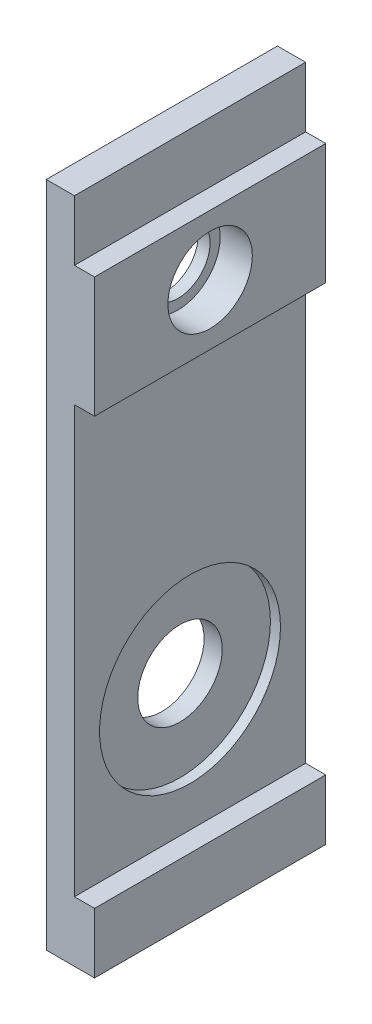
ISO-10303-21;
HEADER;
FILE_DESCRIPTION(('STEP AP214'),'2;1');
FILE_NAME('part.step','',(''),(''),'','','');
FILE_SCHEMA(('AUTOMOTIVE_DESIGN { 1 0 10303 214 1 1 1 1 }'));
ENDSEC;
DATA;
#1=APPLICATION_CONTEXT('core data for automotive mechanical design processes');
#2=APPLICATION_PROTOCOL_DEFINITION('international standard','automotive_design',2000,#1);
#3=PRODUCT_CONTEXT('',#1,'mechanical');
#4=PRODUCT('Part','Part','',(#3));
#5=PRODUCT_RELATED_PRODUCT_CATEGORY('part','',(#4));
#6=PRODUCT_DEFINITION_FORMATION('','',#4);
#7=PRODUCT_DEFINITION_CONTEXT('part definition',#1,'design');
#8=PRODUCT_DEFINITION('design','',#6,#7);
#9=PRODUCT_DEFINITION_SHAPE('','',#8);
#10=(LENGTH_UNIT() NAMED_UNIT(*) SI_UNIT(.MILLI.,.METRE.));
#11=(NAMED_UNIT(*) PLANE_ANGLE_UNIT() SI_UNIT($,.RADIAN.));
#12=(NAMED_UNIT(*) SI_UNIT($,.STERADIAN.) SOLID_ANGLE_UNIT());
#13=UNCERTAINTY_MEASURE_WITH_UNIT(LENGTH_MEASURE(1.E-05),#10,'distance_accuracy_value','');
#14=(GEOMETRIC_REPRESENTATION_CONTEXT(3) GLOBAL_UNCERTAINTY_ASSIGNED_CONTEXT((#13)) GLOBAL_UNIT_ASSIGNED_CONTEXT((#10,
#11,#12)) REPRESENTATION_CONTEXT('',''));
#15=CARTESIAN_POINT('',(0.,0.,0.));
#16=DIRECTION('',(0.,0.,1.));
#17=DIRECTION('',(1.,0.,0.));
#18=AXIS2_PLACEMENT_3D('',#15,#16,#17);
#19=CARTESIAN_POINT('',(-89.2533824815821,13.8635198135198,5.75));
#20=DIRECTION('',(1.,0.,0.));
#21=DIRECTION('',(0.,0.,-1.));
#22=AXIS2_PLACEMENT_3D('',#19,#20,#21);
#23=CYLINDRICAL_SURFACE('',#22,2.1);
#24=CARTESIAN_POINT('',(-86.853382481582,13.8635198135198,5.75));
#25=DIRECTION('',(1.,0.,0.));
#26=DIRECTION('',(0.,0.,-1.));
#27=AXIS2_PLACEMENT_3D('',#24,#25,#26);
#28=CIRCLE('',#27,2.1);
#29=CARTESIAN_POINT('',(-86.853382481582,13.8635198135198,3.65));
#30=VERTEX_POINT('',#29);
#31=EDGE_CURVE('E147',#30,#30,#28,.T.);
#32=ORIENTED_EDGE('',*,*,#31,.T.);
#33=EDGE_LOOP('',(#32));
#34=FACE_BOUND('',#33,.T.);
#35=CARTESIAN_POINT('',(-88.453382481582,13.8635198135198,5.75));
#36=DIRECTION('',(-1.,0.,0.));
#37=DIRECTION('',(0.,0.,1.));
#38=AXIS2_PLACEMENT_3D('',#35,#36,#37);
#39=CIRCLE('',#38,2.1);
#40=CARTESIAN_POINT('',(-88.453382481582,13.8635198135198,7.85));
#41=VERTEX_POINT('',#40);
#42=EDGE_CURVE('E11',#41,#41,#39,.F.);
#43=ORIENTED_EDGE('',*,*,#42,.F.);
#44=EDGE_LOOP('',(#43));
#45=FACE_BOUND('',#44,.T.);
#46=ADVANCED_FACE('F33',(#34,#45),#23,.F.);
#47=CARTESIAN_POINT('',(-89.2533824815821,-3.83648018648019,5.75));
#48=DIRECTION('',(1.,0.,0.));
#49=DIRECTION('',(0.,0.,-1.));
#50=AXIS2_PLACEMENT_3D('',#47,#48,#49);
#51=CYLINDRICAL_SURFACE('',#50,2.1);
#52=CARTESIAN_POINT('',(-89.2533824815821,-3.83648018648019,5.75));
#53=DIRECTION('',(1.,0.,0.));
#54=DIRECTION('',(0.,0.,-1.));
#55=AXIS2_PLACEMENT_3D('',#52,#53,#54);
#56=CIRCLE('',#55,2.1);
#57=CARTESIAN_POINT('',(-89.2533824815821,-3.83648018648019,3.65));
#58=VERTEX_POINT('',#57);
#59=EDGE_CURVE('E183',#58,#58,#56,.T.);
#60=ORIENTED_EDGE('',*,*,#59,.F.);
#61=EDGE_LOOP('',(#60));
#62=FACE_BOUND('',#61,.T.);
#63=CARTESIAN_POINT('',(-88.353382481582,-3.83648018648019,5.75));
#64=DIRECTION('',(1.,0.,0.));
#65=DIRECTION('',(0.,0.,-1.));
#66=AXIS2_PLACEMENT_3D('',#63,#64,#65);
#67=CIRCLE('',#66,2.1);
#68=CARTESIAN_POINT('',(-88.353382481582,-3.83648018648019,3.65));
#69=VERTEX_POINT('',#68);
#70=EDGE_CURVE('E181',#69,#69,#67,.F.);
#71=ORIENTED_EDGE('',*,*,#70,.F.);
#72=EDGE_LOOP('',(#71));
#73=FACE_BOUND('',#72,.T.);
#74=ADVANCED_FACE('F243',(#62,#73),#51,.F.);
#75=CARTESIAN_POINT('',(-89.2533824815821,-13.3364801864802,11.5));
#76=DIRECTION('',(0.,1.,0.));
#77=DIRECTION('',(0.,0.,1.));
#78=AXIS2_PLACEMENT_3D('',#75,#76,#77);
#79=PLANE('',#78);
#80=DIRECTION('',(1.,0.,0.));
#81=VECTOR('',#80,1.);
#82=CARTESIAN_POINT('',(-89.2533824815821,-13.3364801864802,0.));
#83=LINE('',#82,#81);
#84=CARTESIAN_POINT('',(-89.2533824815821,-13.3364801864802,0.));
#85=VERTEX_POINT('',#84);
#86=CARTESIAN_POINT('',(-86.853382481582,-13.3364801864802,0.));
#87=VERTEX_POINT('',#86);
#88=EDGE_CURVE('E143',#85,#87,#83,.T.);
#89=ORIENTED_EDGE('',*,*,#88,.T.);
#90=DIRECTION('',(0.,0.,-1.));
#91=VECTOR('',#90,1.);
#92=CARTESIAN_POINT('',(-86.853382481582,-13.3364801864802,11.5));
#93=LINE('',#92,#91);
#94=CARTESIAN_POINT('',(-86.853382481582,-13.3364801864802,11.5));
#95=VERTEX_POINT('',#94);
#96=EDGE_CURVE('E42',#95,#87,#93,.T.);
#97=ORIENTED_EDGE('',*,*,#96,.F.);
#98=DIRECTION('',(1.,0.,0.));
#99=VECTOR('',#98,1.);
#100=CARTESIAN_POINT('',(-89.2533824815821,-13.3364801864802,11.5));
#101=LINE('',#100,#99);
#102=CARTESIAN_POINT('',(-89.2533824815821,-13.3364801864802,11.5));
#103=VERTEX_POINT('',#102);
#104=EDGE_CURVE('E162',#103,#95,#101,.T.);
#105=ORIENTED_EDGE('',*,*,#104,.F.);
#106=DIRECTION('',(0.,0.,-1.));
#107=VECTOR('',#106,1.);
#108=CARTESIAN_POINT('',(-89.2533824815821,-13.3364801864802,11.5));
#109=LINE('',#108,#107);
#110=EDGE_CURVE('E139',#103,#85,#109,.T.);
#111=ORIENTED_EDGE('',*,*,#110,.T.);
#112=EDGE_LOOP('',(#89,#97,#105,#111));
#113=FACE_BOUND('',#112,.T.);
#114=ADVANCED_FACE('F35',(#113),#79,.F.);
#115=CARTESIAN_POINT('',(-86.853382481582,-13.3364801864802,11.5));
#116=DIRECTION('',(-1.,0.,0.));
#117=DIRECTION('',(0.,0.,1.));
#118=AXIS2_PLACEMENT_3D('',#115,#116,#117);
#119=PLANE('',#118);
#120=DIRECTION('',(0.,1.,0.));
#121=VECTOR('',#120,1.);
#122=CARTESIAN_POINT('',(-86.853382481582,-13.3364801864802,0.));
#123=LINE('',#122,#121);
#124=CARTESIAN_POINT('',(-86.853382481582,-10.3364801864802,0.));
#125=VERTEX_POINT('',#124);
#126=EDGE_CURVE('E146',#87,#125,#123,.T.);
#127=ORIENTED_EDGE('',*,*,#126,.T.);
#128=DIRECTION('',(0.,0.,-1.));
#129=VECTOR('',#128,1.);
#130=CARTESIAN_POINT('',(-86.853382481582,-10.3364801864802,11.5));
#131=LINE('',#130,#129);
#132=CARTESIAN_POINT('',(-86.853382481582,-10.3364801864802,11.5));
#133=VERTEX_POINT('',#132);
#134=EDGE_CURVE('E178',#133,#125,#131,.T.);
#135=ORIENTED_EDGE('',*,*,#134,.F.);
#136=DIRECTION('',(0.,1.,0.));
#137=VECTOR('',#136,1.);
#138=CARTESIAN_POINT('',(-86.853382481582,-13.3364801864802,11.5));
#139=LINE('',#138,#137);
#140=EDGE_CURVE('E100',#95,#133,#139,.T.);
#141=ORIENTED_EDGE('',*,*,#140,.F.);
#142=ORIENTED_EDGE('',*,*,#96,.T.);
#143=EDGE_LOOP('',(#127,#135,#141,#142));
#144=FACE_BOUND('',#143,.T.);
#145=ADVANCED_FACE('F401',(#144),#119,.F.);
#146=CARTESIAN_POINT('',(-86.853382481582,-10.3364801864802,11.5));
#147=DIRECTION('',(0.,-1.,0.));
#148=DIRECTION('',(0.,0.,-1.));
#149=AXIS2_PLACEMENT_3D('',#146,#147,#148);
#150=PLANE('',#149);
#151=DIRECTION('',(-1.,0.,0.));
#152=VECTOR('',#151,1.);
#153=CARTESIAN_POINT('',(-86.853382481582,-10.3364801864802,0.));
#154=LINE('',#153,#152);
#155=CARTESIAN_POINT('',(-87.853382481582,-10.3364801864802,0.));
#156=VERTEX_POINT('',#155);
#157=EDGE_CURVE('E149',#125,#156,#154,.T.);
#158=ORIENTED_EDGE('',*,*,#157,.T.);
#159=DIRECTION('',(0.,0.,-1.));
#160=VECTOR('',#159,1.);
#161=CARTESIAN_POINT('',(-87.853382481582,-10.3364801864802,11.5));
#162=LINE('',#161,#160);
#163=CARTESIAN_POINT('',(-87.853382481582,-10.3364801864802,11.5));
#164=VERTEX_POINT('',#163);
#165=EDGE_CURVE('E175',#164,#156,#162,.T.);
#166=ORIENTED_EDGE('',*,*,#165,.F.);
#167=DIRECTION('',(-1.,0.,0.));
#168=VECTOR('',#167,1.);
#169=CARTESIAN_POINT('',(-86.853382481582,-10.3364801864802,11.5));
#170=LINE('',#169,#168);
#171=EDGE_CURVE('E205',#133,#164,#170,.T.);
#172=ORIENTED_EDGE('',*,*,#171,.F.);
#173=ORIENTED_EDGE('',*,*,#134,.T.);
#174=EDGE_LOOP('',(#158,#166,#172,#173));
#175=FACE_BOUND('',#174,.T.);
#176=ADVANCED_FACE('F358',(#175),#150,.F.);
#177=CARTESIAN_POINT('',(-87.853382481582,10.8635198135198,11.5));
#178=DIRECTION('',(-1.,0.,0.));
#179=DIRECTION('',(0.,0.,1.));
#180=AXIS2_PLACEMENT_3D('',#177,#178,#179);
#181=PLANE('',#180);
#182=CARTESIAN_POINT('',(-87.853382481582,-3.83648018648019,5.75));
#183=DIRECTION('',(1.,0.,0.));
#184=DIRECTION('',(0.,0.,-1.));
#185=AXIS2_PLACEMENT_3D('',#182,#183,#184);
#186=CIRCLE('',#185,4.5);
#187=CARTESIAN_POINT('',(-87.853382481582,-3.83648018648019,1.25));
#188=VERTEX_POINT('',#187);
#189=EDGE_CURVE('E190',#188,#188,#186,.T.);
#190=ORIENTED_EDGE('',*,*,#189,.F.);
#191=EDGE_LOOP('',(#190));
#192=FACE_BOUND('',#191,.T.);
#193=DIRECTION('',(0.,1.,0.));
#194=VECTOR('',#193,1.);
#195=CARTESIAN_POINT('',(-87.853382481582,10.8635198135198,0.));
#196=LINE('',#195,#194);
#197=CARTESIAN_POINT('',(-87.853382481582,10.8635198135198,0.));
#198=VERTEX_POINT('',#197);
#199=EDGE_CURVE('E151',#156,#198,#196,.T.);
#200=ORIENTED_EDGE('',*,*,#199,.T.);
#201=DIRECTION('',(0.,0.,-1.));
#202=VECTOR('',#201,1.);
#203=CARTESIAN_POINT('',(-87.853382481582,10.8635198135198,11.5));
#204=LINE('',#203,#202);
#205=CARTESIAN_POINT('',(-87.853382481582,10.8635198135198,11.5));
#206=VERTEX_POINT('',#205);
#207=EDGE_CURVE('E172',#206,#198,#204,.T.);
#208=ORIENTED_EDGE('',*,*,#207,.F.);
#209=DIRECTION('',(0.,1.,0.));
#210=VECTOR('',#209,1.);
#211=CARTESIAN_POINT('',(-87.853382481582,10.8635198135198,11.5));
#212=LINE('',#211,#210);
#213=EDGE_CURVE('E207',#164,#206,#212,.T.);
#214=ORIENTED_EDGE('',*,*,#213,.F.);
#215=ORIENTED_EDGE('',*,*,#165,.T.);
#216=EDGE_LOOP('',(#200,#208,#214,#215));
#217=FACE_BOUND('',#216,.T.);
#218=ADVANCED_FACE('F353',(#192,#217),#181,.F.);
#219=CARTESIAN_POINT('',(-87.853382481582,10.8635198135198,11.5));
#220=DIRECTION('',(0.,1.,0.));
#221=DIRECTION('',(0.,0.,1.));
#222=AXIS2_PLACEMENT_3D('',#219,#220,#221);
#223=PLANE('',#222);
#224=DIRECTION('',(1.,0.,0.));
#225=VECTOR('',#224,1.);
#226=CARTESIAN_POINT('',(-87.853382481582,10.8635198135198,0.));
#227=LINE('',#226,#225);
#228=CARTESIAN_POINT('',(-86.853382481582,10.8635198135198,0.));
#229=VERTEX_POINT('',#228);
#230=EDGE_CURVE('E153',#198,#229,#227,.T.);
#231=ORIENTED_EDGE('',*,*,#230,.T.);
#232=DIRECTION('',(0.,0.,-1.));
#233=VECTOR('',#232,1.);
#234=CARTESIAN_POINT('',(-86.853382481582,10.8635198135198,11.5));
#235=LINE('',#234,#233);
#236=CARTESIAN_POINT('',(-86.853382481582,10.8635198135198,11.5));
#237=VERTEX_POINT('',#236);
#238=EDGE_CURVE('E169',#237,#229,#235,.T.);
#239=ORIENTED_EDGE('',*,*,#238,.F.);
#240=DIRECTION('',(1.,0.,0.));
#241=VECTOR('',#240,1.);
#242=CARTESIAN_POINT('',(-87.853382481582,10.8635198135198,11.5));
#243=LINE('',#242,#241);
#244=EDGE_CURVE('E209',#206,#237,#243,.T.);
#245=ORIENTED_EDGE('',*,*,#244,.F.);
#246=ORIENTED_EDGE('',*,*,#207,.T.);
#247=EDGE_LOOP('',(#231,#239,#245,#246));
#248=FACE_BOUND('',#247,.T.);
#249=ADVANCED_FACE('F357',(#248),#223,.F.);
#250=CARTESIAN_POINT('',(-86.853382481582,10.8635198135198,11.5));
#251=DIRECTION('',(-1.,0.,0.));
#252=DIRECTION('',(0.,0.,1.));
#253=AXIS2_PLACEMENT_3D('',#250,#251,#252);
#254=PLANE('',#253);
#255=ORIENTED_EDGE('',*,*,#31,.F.);
#256=EDGE_LOOP('',(#255));
#257=FACE_BOUND('',#256,.T.);
#258=DIRECTION('',(0.,1.,0.));
#259=VECTOR('',#258,1.);
#260=CARTESIAN_POINT('',(-86.853382481582,10.8635198135198,0.));
#261=LINE('',#260,#259);
#262=CARTESIAN_POINT('',(-86.853382481582,16.8635198135198,0.));
#263=VERTEX_POINT('',#262);
#264=EDGE_CURVE('E155',#229,#263,#261,.T.);
#265=ORIENTED_EDGE('',*,*,#264,.T.);
#266=DIRECTION('',(0.,0.,-1.));
#267=VECTOR('',#266,1.);
#268=CARTESIAN_POINT('',(-86.853382481582,16.8635198135198,11.5));
#269=LINE('',#268,#267);
#270=CARTESIAN_POINT('',(-86.853382481582,16.8635198135198,11.5));
#271=VERTEX_POINT('',#270);
#272=EDGE_CURVE('E166',#271,#263,#269,.T.);
#273=ORIENTED_EDGE('',*,*,#272,.F.);
#274=DIRECTION('',(0.,1.,0.));
#275=VECTOR('',#274,1.);
#276=CARTESIAN_POINT('',(-86.853382481582,10.8635198135198,11.5));
#277=LINE('',#276,#275);
#278=EDGE_CURVE('E211',#237,#271,#277,.T.);
#279=ORIENTED_EDGE('',*,*,#278,.F.);
#280=ORIENTED_EDGE('',*,*,#238,.T.);
#281=EDGE_LOOP('',(#265,#273,#279,#280));
#282=FACE_BOUND('',#281,.T.);
#283=ADVANCED_FACE('F217',(#257,#282),#254,.F.);
#284=CARTESIAN_POINT('',(-86.853382481582,16.8635198135198,11.5));
#285=DIRECTION('',(0.,-1.,0.));
#286=DIRECTION('',(0.,0.,-1.));
#287=AXIS2_PLACEMENT_3D('',#284,#285,#286);
#288=PLANE('',#287);
#289=DIRECTION('',(-1.,0.,0.));
#290=VECTOR('',#289,1.);
#291=CARTESIAN_POINT('',(-86.853382481582,16.8635198135198,0.));
#292=LINE('',#291,#290);
#293=CARTESIAN_POINT('',(-87.853382481582,16.8635198135198,0.));
#294=VERTEX_POINT('',#293);
#295=EDGE_CURVE('E157',#263,#294,#292,.T.);
#296=ORIENTED_EDGE('',*,*,#295,.T.);
#297=DIRECTION('',(0.,0.,-1.));
#298=VECTOR('',#297,1.);
#299=CARTESIAN_POINT('',(-87.853382481582,16.8635198135198,11.5));
#300=LINE('',#299,#298);
#301=CARTESIAN_POINT('',(-87.853382481582,16.8635198135198,11.5));
#302=VERTEX_POINT('',#301);
#303=EDGE_CURVE('E134',#302,#294,#300,.T.);
#304=ORIENTED_EDGE('',*,*,#303,.F.);
#305=DIRECTION('',(-1.,0.,0.));
#306=VECTOR('',#305,1.);
#307=CARTESIAN_POINT('',(-86.853382481582,16.8635198135198,11.5));
#308=LINE('',#307,#306);
#309=EDGE_CURVE('E125',#271,#302,#308,.T.);
#310=ORIENTED_EDGE('',*,*,#309,.F.);
#311=ORIENTED_EDGE('',*,*,#272,.T.);
#312=EDGE_LOOP('',(#296,#304,#310,#311));
#313=FACE_BOUND('',#312,.T.);
#314=ADVANCED_FACE('F221',(#313),#288,.F.);
#315=CARTESIAN_POINT('',(-87.853382481582,16.8635198135198,11.5));
#316=DIRECTION('',(-1.,0.,0.));
#317=DIRECTION('',(0.,0.,1.));
#318=AXIS2_PLACEMENT_3D('',#315,#316,#317);
#319=PLANE('',#318);
#320=DIRECTION('',(0.,1.,0.));
#321=VECTOR('',#320,1.);
#322=CARTESIAN_POINT('',(-87.853382481582,16.8635198135198,0.));
#323=LINE('',#322,#321);
#324=CARTESIAN_POINT('',(-87.853382481582,19.8635198135198,0.));
#325=VERTEX_POINT('',#324);
#326=EDGE_CURVE('E133',#294,#325,#323,.T.);
#327=ORIENTED_EDGE('',*,*,#326,.T.);
#328=DIRECTION('',(0.,0.,-1.));
#329=VECTOR('',#328,1.);
#330=CARTESIAN_POINT('',(-87.853382481582,19.8635198135198,11.5));
#331=LINE('',#330,#329);
#332=CARTESIAN_POINT('',(-87.853382481582,19.8635198135198,11.5));
#333=VERTEX_POINT('',#332);
#334=EDGE_CURVE('E130',#333,#325,#331,.T.);
#335=ORIENTED_EDGE('',*,*,#334,.F.);
#336=DIRECTION('',(0.,1.,0.));
#337=VECTOR('',#336,1.);
#338=CARTESIAN_POINT('',(-87.853382481582,16.8635198135198,11.5));
#339=LINE('',#338,#337);
#340=EDGE_CURVE('E119',#302,#333,#339,.T.);
#341=ORIENTED_EDGE('',*,*,#340,.F.);
#342=ORIENTED_EDGE('',*,*,#303,.T.);
#343=EDGE_LOOP('',(#327,#335,#341,#342));
#344=FACE_BOUND('',#343,.T.);
#345=ADVANCED_FACE('F131',(#344),#319,.F.);
#346=CARTESIAN_POINT('',(-89.2533824815821,19.8635198135198,11.5));
#347=DIRECTION('',(0.,-1.,0.));
#348=DIRECTION('',(0.,0.,-1.));
#349=AXIS2_PLACEMENT_3D('',#346,#347,#348);
#350=PLANE('',#349);
#351=DIRECTION('',(-1.,0.,0.));
#352=VECTOR('',#351,1.);
#353=CARTESIAN_POINT('',(-89.2533824815821,19.8635198135198,0.));
#354=LINE('',#353,#352);
#355=CARTESIAN_POINT('',(-89.2533824815821,19.8635198135198,0.));
#356=VERTEX_POINT('',#355);
#357=EDGE_CURVE('E85',#325,#356,#354,.T.);
#358=ORIENTED_EDGE('',*,*,#357,.T.);
#359=DIRECTION('',(0.,0.,-1.));
#360=VECTOR('',#359,1.);
#361=CARTESIAN_POINT('',(-89.2533824815821,19.8635198135198,11.5));
#362=LINE('',#361,#360);
#363=CARTESIAN_POINT('',(-89.2533824815821,19.8635198135198,11.5));
#364=VERTEX_POINT('',#363);
#365=EDGE_CURVE('E135',#364,#356,#362,.T.);
#366=ORIENTED_EDGE('',*,*,#365,.F.);
#367=DIRECTION('',(-1.,0.,0.));
#368=VECTOR('',#367,1.);
#369=CARTESIAN_POINT('',(-89.2533824815821,19.8635198135198,11.5));
#370=LINE('',#369,#368);
#371=EDGE_CURVE('E123',#333,#364,#370,.T.);
#372=ORIENTED_EDGE('',*,*,#371,.F.);
#373=ORIENTED_EDGE('',*,*,#334,.T.);
#374=EDGE_LOOP('',(#358,#366,#372,#373));
#375=FACE_BOUND('',#374,.T.);
#376=ADVANCED_FACE('F137',(#375),#350,.F.);
#377=CARTESIAN_POINT('',(-89.2533824815821,-13.3364801864802,11.5));
#378=DIRECTION('',(1.,0.,0.));
#379=DIRECTION('',(0.,0.,-1.));
#380=AXIS2_PLACEMENT_3D('',#377,#378,#379);
#381=PLANE('',#380);
#382=CARTESIAN_POINT('',(-89.2533824815821,13.8635198135198,5.75));
#383=DIRECTION('',(-1.,0.,0.));
#384=DIRECTION('',(0.,0.,1.));
#385=AXIS2_PLACEMENT_3D('',#382,#383,#384);
#386=CIRCLE('',#385,3.);
#387=CARTESIAN_POINT('',(-89.2533824815821,13.8635198135198,8.75));
#388=VERTEX_POINT('',#387);
#389=EDGE_CURVE('E198',#388,#388,#386,.T.);
#390=ORIENTED_EDGE('',*,*,#389,.F.);
#391=EDGE_LOOP('',(#390));
#392=FACE_BOUND('',#391,.T.);
#393=ORIENTED_EDGE('',*,*,#59,.T.);
#394=EDGE_LOOP('',(#393));
#395=FACE_BOUND('',#394,.T.);
#396=DIRECTION('',(0.,-1.,0.));
#397=VECTOR('',#396,1.);
#398=CARTESIAN_POINT('',(-89.2533824815821,-13.3364801864802,0.));
#399=LINE('',#398,#397);
#400=EDGE_CURVE('E91',#356,#85,#399,.T.);
#401=ORIENTED_EDGE('',*,*,#400,.T.);
#402=ORIENTED_EDGE('',*,*,#110,.F.);
#403=DIRECTION('',(0.,-1.,0.));
#404=VECTOR('',#403,1.);
#405=CARTESIAN_POINT('',(-89.2533824815821,-13.3364801864802,11.5));
#406=LINE('',#405,#404);
#407=EDGE_CURVE('E50',#364,#103,#406,.T.);
#408=ORIENTED_EDGE('',*,*,#407,.F.);
#409=ORIENTED_EDGE('',*,*,#365,.T.);
#410=EDGE_LOOP('',(#401,#402,#408,#409));
#411=FACE_BOUND('',#410,.T.);
#412=ADVANCED_FACE('F229',(#392,#395,#411),#381,.F.);
#413=CARTESIAN_POINT('',(0.,0.,11.5));
#414=DIRECTION('',(0.,0.,1.));
#415=DIRECTION('',(1.,0.,0.));
#416=AXIS2_PLACEMENT_3D('',#413,#414,#415);
#417=PLANE('',#416);
#418=ORIENTED_EDGE('',*,*,#104,.T.);
#419=ORIENTED_EDGE('',*,*,#140,.T.);
#420=ORIENTED_EDGE('',*,*,#171,.T.);
#421=ORIENTED_EDGE('',*,*,#213,.T.);
#422=ORIENTED_EDGE('',*,*,#244,.T.);
#423=ORIENTED_EDGE('',*,*,#278,.T.);
#424=ORIENTED_EDGE('',*,*,#309,.T.);
#425=ORIENTED_EDGE('',*,*,#340,.T.);
#426=ORIENTED_EDGE('',*,*,#371,.T.);
#427=ORIENTED_EDGE('',*,*,#407,.T.);
#428=EDGE_LOOP('',(#418,#419,#420,#421,#422,#423,#424,#425,#426,#427));
#429=FACE_BOUND('',#428,.T.);
#430=ADVANCED_FACE('F121',(#429),#417,.T.);
#431=CARTESIAN_POINT('',(0.,0.,0.));
#432=DIRECTION('',(0.,0.,1.));
#433=DIRECTION('',(1.,0.,0.));
#434=AXIS2_PLACEMENT_3D('',#431,#432,#433);
#435=PLANE('',#434);
#436=ORIENTED_EDGE('',*,*,#88,.F.);
#437=ORIENTED_EDGE('',*,*,#400,.F.);
#438=ORIENTED_EDGE('',*,*,#357,.F.);
#439=ORIENTED_EDGE('',*,*,#326,.F.);
#440=ORIENTED_EDGE('',*,*,#295,.F.);
#441=ORIENTED_EDGE('',*,*,#264,.F.);
#442=ORIENTED_EDGE('',*,*,#230,.F.);
#443=ORIENTED_EDGE('',*,*,#199,.F.);
#444=ORIENTED_EDGE('',*,*,#157,.F.);
#445=ORIENTED_EDGE('',*,*,#126,.F.);
#446=EDGE_LOOP('',(#436,#437,#438,#439,#440,#441,#442,#443,#444,#445));
#447=FACE_BOUND('',#446,.T.);
#448=ADVANCED_FACE('F224',(#447),#435,.F.);
#449=CARTESIAN_POINT('',(-88.353382481582,-3.83648018648019,5.75));
#450=DIRECTION('',(1.,0.,0.));
#451=DIRECTION('',(0.,0.,-1.));
#452=AXIS2_PLACEMENT_3D('',#449,#450,#451);
#453=PLANE('',#452);
#454=CARTESIAN_POINT('',(-88.353382481582,-3.83648018648019,5.75));
#455=DIRECTION('',(1.,0.,0.));
#456=DIRECTION('',(0.,0.,-1.));
#457=AXIS2_PLACEMENT_3D('',#454,#455,#456);
#458=CIRCLE('',#457,4.5);
#459=CARTESIAN_POINT('',(-88.353382481582,-3.83648018648019,1.25));
#460=VERTEX_POINT('',#459);
#461=EDGE_CURVE('E184',#460,#460,#458,.T.);
#462=ORIENTED_EDGE('',*,*,#461,.T.);
#463=EDGE_LOOP('',(#462));
#464=FACE_BOUND('',#463,.T.);
#465=ORIENTED_EDGE('',*,*,#70,.T.);
#466=EDGE_LOOP('',(#465));
#467=FACE_BOUND('',#466,.T.);
#468=ADVANCED_FACE('F256',(#464,#467),#453,.T.);
#469=CARTESIAN_POINT('',(-88.353382481582,-3.83648018648019,5.75));
#470=DIRECTION('',(1.,0.,0.));
#471=DIRECTION('',(0.,0.,-1.));
#472=AXIS2_PLACEMENT_3D('',#469,#470,#471);
#473=CYLINDRICAL_SURFACE('',#472,4.5);
#474=ORIENTED_EDGE('',*,*,#461,.F.);
#475=EDGE_LOOP('',(#474));
#476=FACE_BOUND('',#475,.T.);
#477=ORIENTED_EDGE('',*,*,#189,.T.);
#478=EDGE_LOOP('',(#477));
#479=FACE_BOUND('',#478,.T.);
#480=ADVANCED_FACE('F253',(#476,#479),#473,.F.);
#481=CARTESIAN_POINT('',(-89.053382481582,13.8635198135198,5.75));
#482=DIRECTION('',(-1.,0.,0.));
#483=DIRECTION('',(0.,0.,1.));
#484=AXIS2_PLACEMENT_3D('',#481,#482,#483);
#485=PLANE('',#484);
#486=CARTESIAN_POINT('',(-89.053382481582,13.8635198135198,5.75));
#487=DIRECTION('',(-1.,0.,0.));
#488=DIRECTION('',(0.,0.,1.));
#489=AXIS2_PLACEMENT_3D('',#486,#487,#488);
#490=CIRCLE('',#489,3.);
#491=CARTESIAN_POINT('',(-89.053382481582,13.8635198135198,8.75));
#492=VERTEX_POINT('',#491);
#493=EDGE_CURVE('E195',#492,#492,#490,.T.);
#494=ORIENTED_EDGE('',*,*,#493,.T.);
#495=EDGE_LOOP('',(#494));
#496=FACE_BOUND('',#495,.T.);
#497=CARTESIAN_POINT('',(-89.053382481582,13.8635198135198,5.75));
#498=DIRECTION('',(-1.,0.,0.));
#499=DIRECTION('',(0.,0.,1.));
#500=AXIS2_PLACEMENT_3D('',#497,#498,#499);
#501=CIRCLE('',#500,1.6);
#502=CARTESIAN_POINT('',(-89.053382481582,13.8635198135198,7.35));
#503=VERTEX_POINT('',#502);
#504=EDGE_CURVE('E288',#503,#503,#501,.T.);
#505=ORIENTED_EDGE('',*,*,#504,.F.);
#506=EDGE_LOOP('',(#505));
#507=FACE_BOUND('',#506,.T.);
#508=ADVANCED_FACE('F263',(#496,#507),#485,.T.);
#509=CARTESIAN_POINT('',(-89.053382481582,13.8635198135198,5.75));
#510=DIRECTION('',(-1.,0.,0.));
#511=DIRECTION('',(0.,0.,1.));
#512=AXIS2_PLACEMENT_3D('',#509,#510,#511);
#513=CYLINDRICAL_SURFACE('',#512,3.);
#514=ORIENTED_EDGE('',*,*,#493,.F.);
#515=EDGE_LOOP('',(#514));
#516=FACE_BOUND('',#515,.T.);
#517=ORIENTED_EDGE('',*,*,#389,.T.);
#518=EDGE_LOOP('',(#517));
#519=FACE_BOUND('',#518,.T.);
#520=ADVANCED_FACE('F266',(#516,#519),#513,.F.);
#521=CARTESIAN_POINT('',(-88.453382481582,13.8635198135198,5.75));
#522=DIRECTION('',(-1.,0.,0.));
#523=DIRECTION('',(0.,0.,1.));
#524=AXIS2_PLACEMENT_3D('',#521,#522,#523);
#525=PLANE('',#524);
#526=CARTESIAN_POINT('',(-88.453382481582,13.8635198135198,5.75));
#527=DIRECTION('',(-1.,0.,0.));
#528=DIRECTION('',(0.,0.,1.));
#529=AXIS2_PLACEMENT_3D('',#526,#527,#528);
#530=CIRCLE('',#529,1.6);
#531=CARTESIAN_POINT('',(-88.453382481582,13.8635198135198,7.35));
#532=VERTEX_POINT('',#531);
#533=EDGE_CURVE('E285',#532,#532,#530,.T.);
#534=ORIENTED_EDGE('',*,*,#533,.T.);
#535=EDGE_LOOP('',(#534));
#536=FACE_BOUND('',#535,.T.);
#537=ORIENTED_EDGE('',*,*,#42,.T.);
#538=EDGE_LOOP('',(#537));
#539=FACE_BOUND('',#538,.T.);
#540=ADVANCED_FACE('F269',(#536,#539),#525,.F.);
#541=CARTESIAN_POINT('',(-88.453382481582,13.8635198135198,5.75));
#542=DIRECTION('',(-1.,0.,0.));
#543=DIRECTION('',(0.,0.,1.));
#544=AXIS2_PLACEMENT_3D('',#541,#542,#543);
#545=CYLINDRICAL_SURFACE('',#544,1.6);
#546=ORIENTED_EDGE('',*,*,#533,.F.);
#547=EDGE_LOOP('',(#546));
#548=FACE_BOUND('',#547,.T.);
#549=ORIENTED_EDGE('',*,*,#504,.T.);
#550=EDGE_LOOP('',(#549));
#551=FACE_BOUND('',#550,.T.);
#552=ADVANCED_FACE('F276',(#548,#551),#545,.F.);
#553=CLOSED_SHELL('',(#46,#74,#114,#145,#176,#218,#249,#283,#314,#345,#376,#412,#430,#448,#468,
#480,#508,#520,#540,#552));
#554=MANIFOLD_SOLID_BREP('B2',#553);
#555=ADVANCED_BREP_SHAPE_REPRESENTATION('',(#18,#554),#14);
#556=SHAPE_DEFINITION_REPRESENTATION(#9,#555);
ENDSEC;
END-ISO-10303-21;
